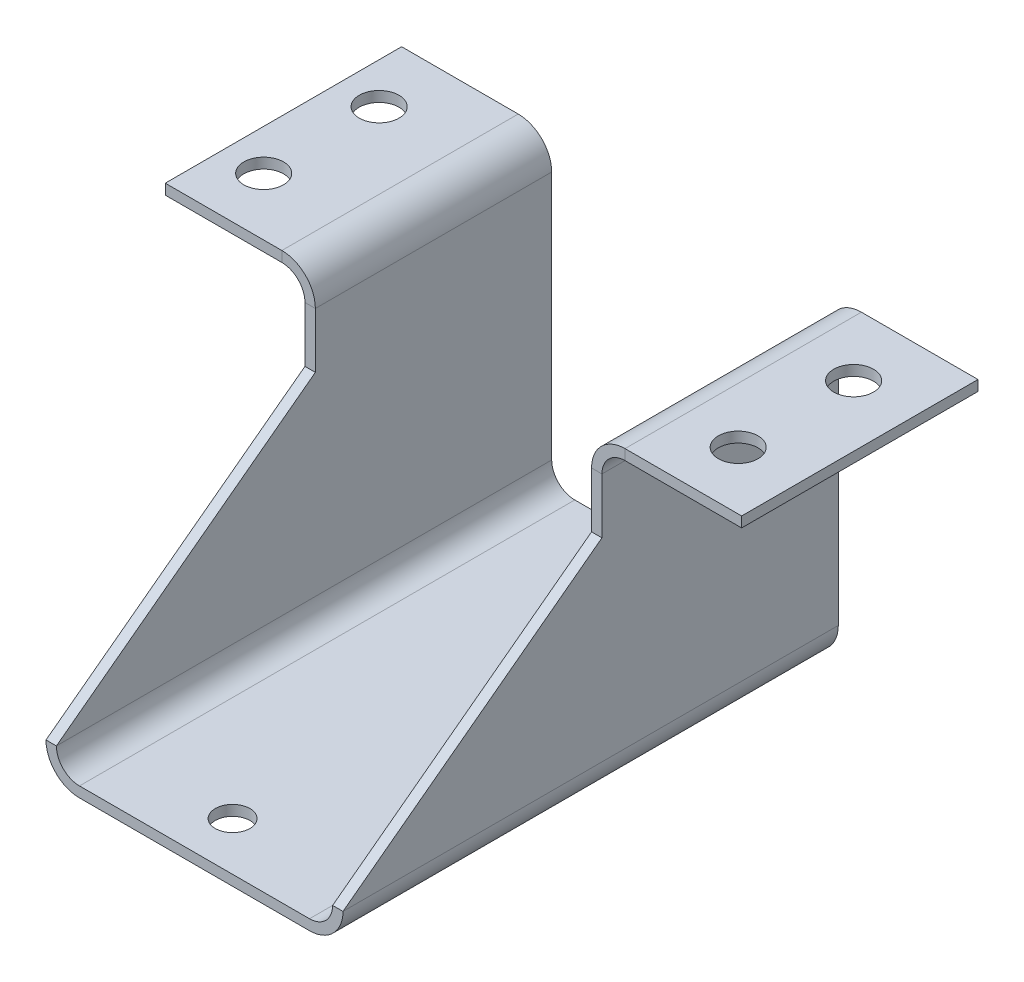
ISO-10303-21;
HEADER;
FILE_DESCRIPTION(('STEP AP214'),'2;1');
FILE_NAME('part.step','',(''),(''),'','','');
FILE_SCHEMA(('AUTOMOTIVE_DESIGN { 1 0 10303 214 1 1 1 1 }'));
ENDSEC;
DATA;
#1=APPLICATION_CONTEXT('core data for automotive mechanical design processes');
#2=APPLICATION_PROTOCOL_DEFINITION('international standard','automotive_design',2000,#1);
#3=PRODUCT_CONTEXT('',#1,'mechanical');
#4=PRODUCT('Part','Part','',(#3));
#5=PRODUCT_RELATED_PRODUCT_CATEGORY('part','',(#4));
#6=PRODUCT_DEFINITION_FORMATION('','',#4);
#7=PRODUCT_DEFINITION_CONTEXT('part definition',#1,'design');
#8=PRODUCT_DEFINITION('design','',#6,#7);
#9=PRODUCT_DEFINITION_SHAPE('','',#8);
#10=(LENGTH_UNIT() NAMED_UNIT(*) SI_UNIT(.MILLI.,.METRE.));
#11=(NAMED_UNIT(*) PLANE_ANGLE_UNIT() SI_UNIT($,.RADIAN.));
#12=(NAMED_UNIT(*) SI_UNIT($,.STERADIAN.) SOLID_ANGLE_UNIT());
#13=UNCERTAINTY_MEASURE_WITH_UNIT(LENGTH_MEASURE(1.E-05),#10,'distance_accuracy_value','');
#14=(GEOMETRIC_REPRESENTATION_CONTEXT(3) GLOBAL_UNCERTAINTY_ASSIGNED_CONTEXT((#13)) GLOBAL_UNIT_ASSIGNED_CONTEXT((#10,
#11,#12)) REPRESENTATION_CONTEXT('',''));
#15=CARTESIAN_POINT('',(0.,0.,0.));
#16=DIRECTION('',(0.,0.,1.));
#17=DIRECTION('',(1.,0.,0.));
#18=AXIS2_PLACEMENT_3D('',#15,#16,#17);
#19=CARTESIAN_POINT('',(-30.4165000000002,129.031539145061,-87.3411607187525));
#20=DIRECTION('',(0.,0.,1.));
#21=DIRECTION('',(0.,-1.,0.));
#22=AXIS2_PLACEMENT_3D('',#19,#20,#21);
#23=PLANE('',#22);
#24=DIRECTION('',(-1.,0.,0.));
#25=VECTOR('',#24,1.);
#26=CARTESIAN_POINT('',(34.9250000000002,59.944,-87.3411607187525));
#27=LINE('',#26,#25);
#28=CARTESIAN_POINT('',(34.9250000000002,59.944,-87.3411607187525));
#29=VERTEX_POINT('',#28);
#30=CARTESIAN_POINT('',(32.6390000000002,59.944,-87.3411607187525));
#31=VERTEX_POINT('',#30);
#32=EDGE_CURVE('E329',#29,#31,#27,.T.);
#33=ORIENTED_EDGE('',*,*,#32,.F.);
#34=DIRECTION('',(0.,-1.,0.));
#35=VECTOR('',#34,1.);
#36=CARTESIAN_POINT('',(34.9250000000003,129.031539145061,-87.3411607187525));
#37=LINE('',#36,#35);
#38=CARTESIAN_POINT('',(34.9250000000003,5.07999999999997,-87.3411607187525));
#39=VERTEX_POINT('',#38);
#40=EDGE_CURVE('E384',#29,#39,#37,.T.);
#41=ORIENTED_EDGE('',*,*,#40,.T.);
#42=DIRECTION('',(-1.,0.,0.));
#43=VECTOR('',#42,1.);
#44=CARTESIAN_POINT('',(34.9250000000003,5.07999999999997,-87.3411607187525));
#45=LINE('',#44,#43);
#46=CARTESIAN_POINT('',(32.639,5.07999999999998,-87.3411607187525));
#47=VERTEX_POINT('',#46);
#48=EDGE_CURVE('E13',#39,#47,#45,.T.);
#49=ORIENTED_EDGE('',*,*,#48,.T.);
#50=DIRECTION('',(0.,1.,0.));
#51=VECTOR('',#50,1.);
#52=CARTESIAN_POINT('',(32.639,-1.0916021745063E-13,-87.3411607187525));
#53=LINE('',#52,#51);
#54=EDGE_CURVE('E390',#47,#31,#53,.T.);
#55=ORIENTED_EDGE('',*,*,#54,.T.);
#56=EDGE_LOOP('',(#33,#41,#49,#55));
#57=FACE_BOUND('',#56,.T.);
#58=ADVANCED_FACE('F120',(#57),#23,.F.);
#59=CARTESIAN_POINT('',(34.925,-1.30394088607638E-13,0.));
#60=DIRECTION('',(-1.,0.,0.));
#61=DIRECTION('',(0.,-1.,0.));
#62=AXIS2_PLACEMENT_3D('',#59,#60,#61);
#63=PLANE('',#62);
#64=DIRECTION('',(0.,0.,1.));
#65=VECTOR('',#64,1.);
#66=CARTESIAN_POINT('',(34.9250000000002,59.944,-35.3411607187525));
#67=LINE('',#66,#65);
#68=CARTESIAN_POINT('',(34.9250000000002,59.944,-35.3411607187525));
#69=VERTEX_POINT('',#68);
#70=EDGE_CURVE('E324',#69,#29,#67,.F.);
#71=ORIENTED_EDGE('',*,*,#70,.F.);
#72=DIRECTION('',(0.,1.,0.));
#73=VECTOR('',#72,1.);
#74=CARTESIAN_POINT('',(34.9250000000003,149.369143464404,-35.3411607187524));
#75=LINE('',#74,#73);
#76=CARTESIAN_POINT('',(34.9250000000003,47.7691434644041,-35.3411607187525));
#77=VERTEX_POINT('',#76);
#78=EDGE_CURVE('E416',#77,#69,#75,.T.);
#79=ORIENTED_EDGE('',*,*,#78,.F.);
#80=DIRECTION('',(0.,0.599640285875703,-0.800269659274238));
#81=VECTOR('',#80,1.);
#82=CARTESIAN_POINT('',(34.9250000000003,47.7691434644041,-35.3411607187525));
#83=LINE('',#82,#81);
#84=CARTESIAN_POINT('',(34.9250000000003,5.07999999999997,21.6310392812475));
#85=VERTEX_POINT('',#84);
#86=EDGE_CURVE('E413',#85,#77,#83,.T.);
#87=ORIENTED_EDGE('',*,*,#86,.F.);
#88=DIRECTION('',(0.,0.,-1.));
#89=VECTOR('',#88,1.);
#90=CARTESIAN_POINT('',(34.925,5.07999999999998,25.4));
#91=LINE('',#90,#89);
#92=EDGE_CURVE('E452',#39,#85,#91,.F.);
#93=ORIENTED_EDGE('',*,*,#92,.F.);
#94=ORIENTED_EDGE('',*,*,#40,.F.);
#95=EDGE_LOOP('',(#71,#79,#87,#93,#94));
#96=FACE_BOUND('',#95,.T.);
#97=ADVANCED_FACE('F542',(#96),#63,.F.);
#98=CARTESIAN_POINT('',(32.639,-1.22412562267043E-13,0.));
#99=DIRECTION('',(-1.,0.,0.));
#100=DIRECTION('',(0.,-1.,0.));
#101=AXIS2_PLACEMENT_3D('',#98,#99,#100);
#102=PLANE('',#101);
#103=DIRECTION('',(0.,-1.,0.));
#104=VECTOR('',#103,1.);
#105=CARTESIAN_POINT('',(32.639,-1.15171561341796E-13,-35.3411607187525));
#106=LINE('',#105,#104);
#107=CARTESIAN_POINT('',(32.6390000000002,59.944,-35.3411607187525));
#108=VERTEX_POINT('',#107);
#109=CARTESIAN_POINT('',(32.6390000000002,47.7691434644041,-35.3411607187525));
#110=VERTEX_POINT('',#109);
#111=EDGE_CURVE('E429',#108,#110,#106,.T.);
#112=ORIENTED_EDGE('',*,*,#111,.F.);
#113=DIRECTION('',(0.,0.,1.));
#114=VECTOR('',#113,1.);
#115=CARTESIAN_POINT('',(32.6390000000002,59.944,-35.3411607187525));
#116=LINE('',#115,#114);
#117=EDGE_CURVE('E313',#108,#31,#116,.F.);
#118=ORIENTED_EDGE('',*,*,#117,.T.);
#119=ORIENTED_EDGE('',*,*,#54,.F.);
#120=DIRECTION('',(0.,0.,-1.));
#121=VECTOR('',#120,1.);
#122=CARTESIAN_POINT('',(32.639,5.07999999999998,25.4));
#123=LINE('',#122,#121);
#124=CARTESIAN_POINT('',(32.6390000000001,5.07999999999997,21.6310392812475));
#125=VERTEX_POINT('',#124);
#126=EDGE_CURVE('E451',#125,#47,#123,.T.);
#127=ORIENTED_EDGE('',*,*,#126,.F.);
#128=DIRECTION('',(0.,-0.599640285875703,0.800269659274238));
#129=VECTOR('',#128,1.);
#130=CARTESIAN_POINT('',(32.6390000000001,13.6335639306915,10.2155993022635));
#131=LINE('',#130,#129);
#132=EDGE_CURVE('E469',#110,#125,#131,.T.);
#133=ORIENTED_EDGE('',*,*,#132,.F.);
#134=EDGE_LOOP('',(#112,#118,#119,#127,#133));
#135=FACE_BOUND('',#134,.T.);
#136=ADVANCED_FACE('F550',(#135),#102,.T.);
#137=CARTESIAN_POINT('',(-30.4165000000002,149.369143464404,-35.3411607187524));
#138=DIRECTION('',(0.,0.,-1.));
#139=DIRECTION('',(0.,1.,0.));
#140=AXIS2_PLACEMENT_3D('',#137,#138,#139);
#141=PLANE('',#140);
#142=DIRECTION('',(-1.,0.,0.));
#143=VECTOR('',#142,1.);
#144=CARTESIAN_POINT('',(34.9250000000002,59.944,-35.3411607187525));
#145=LINE('',#144,#143);
#146=EDGE_CURVE('E318',#69,#108,#145,.T.);
#147=ORIENTED_EDGE('',*,*,#146,.T.);
#148=ORIENTED_EDGE('',*,*,#111,.T.);
#149=DIRECTION('',(1.,0.,0.));
#150=VECTOR('',#149,1.);
#151=CARTESIAN_POINT('',(-30.4165000000002,47.7691434644041,-35.3411607187525));
#152=LINE('',#151,#150);
#153=EDGE_CURVE('E425',#110,#77,#152,.T.);
#154=ORIENTED_EDGE('',*,*,#153,.T.);
#155=ORIENTED_EDGE('',*,*,#78,.T.);
#156=EDGE_LOOP('',(#147,#148,#154,#155));
#157=FACE_BOUND('',#156,.T.);
#158=ADVANCED_FACE('F558',(#157),#141,.F.);
#159=DIRECTION('',(1.,0.,0.));
#160=VECTOR('',#159,1.);
#161=CARTESIAN_POINT('',(-30.4165000000002,59.944,-87.3411607187524));
#162=LINE('',#161,#160);
#163=CARTESIAN_POINT('',(-30.4165000000002,59.944,-87.3411607187524));
#164=VERTEX_POINT('',#163);
#165=CARTESIAN_POINT('',(-28.1305000000002,59.944,-87.3411607187524));
#166=VERTEX_POINT('',#165);
#167=EDGE_CURVE('E371',#164,#166,#162,.T.);
#168=ORIENTED_EDGE('',*,*,#167,.T.);
#169=DIRECTION('',(0.,-1.,0.));
#170=VECTOR('',#169,1.);
#171=CARTESIAN_POINT('',(-28.1305,0.,-87.3411607187525));
#172=LINE('',#171,#170);
#173=CARTESIAN_POINT('',(-28.1305,5.07999999999999,-87.3411607187525));
#174=VERTEX_POINT('',#173);
#175=EDGE_CURVE('E402',#166,#174,#172,.T.);
#176=ORIENTED_EDGE('',*,*,#175,.T.);
#177=DIRECTION('',(-1.,0.,0.));
#178=VECTOR('',#177,1.);
#179=CARTESIAN_POINT('',(-28.1305,5.07999999999999,-87.3411607187525));
#180=LINE('',#179,#178);
#181=CARTESIAN_POINT('',(-30.4165000000002,5.07999999999997,-87.3411607187525));
#182=VERTEX_POINT('',#181);
#183=EDGE_CURVE('E478',#174,#182,#180,.T.);
#184=ORIENTED_EDGE('',*,*,#183,.T.);
#185=DIRECTION('',(0.,-1.,0.));
#186=VECTOR('',#185,1.);
#187=CARTESIAN_POINT('',(-30.4165000000002,129.031539145061,-87.3411607187525));
#188=LINE('',#187,#186);
#189=EDGE_CURVE('E388',#164,#182,#188,.T.);
#190=ORIENTED_EDGE('',*,*,#189,.F.);
#191=EDGE_LOOP('',(#168,#176,#184,#190));
#192=FACE_BOUND('',#191,.T.);
#193=ADVANCED_FACE('F545',(#192),#23,.F.);
#194=CARTESIAN_POINT('',(-30.4165,-1.14591739660438E-13,0.));
#195=DIRECTION('',(1.,0.,0.));
#196=DIRECTION('',(0.,1.,0.));
#197=AXIS2_PLACEMENT_3D('',#194,#195,#196);
#198=PLANE('',#197);
#199=DIRECTION('',(0.,0.,-1.));
#200=VECTOR('',#199,1.);
#201=CARTESIAN_POINT('',(-30.4165000000002,59.944,-87.3411607187524));
#202=LINE('',#201,#200);
#203=CARTESIAN_POINT('',(-30.4165000000002,59.944,-35.3411607187524));
#204=VERTEX_POINT('',#203);
#205=EDGE_CURVE('E377',#164,#204,#202,.F.);
#206=ORIENTED_EDGE('',*,*,#205,.F.);
#207=ORIENTED_EDGE('',*,*,#189,.T.);
#208=DIRECTION('',(0.,0.,1.));
#209=VECTOR('',#208,1.);
#210=CARTESIAN_POINT('',(-30.4165,5.07999999999997,-152.4));
#211=LINE('',#210,#209);
#212=CARTESIAN_POINT('',(-30.4165000000002,5.07999999999997,21.6310392812475));
#213=VERTEX_POINT('',#212);
#214=EDGE_CURVE('E461',#213,#182,#211,.F.);
#215=ORIENTED_EDGE('',*,*,#214,.F.);
#216=DIRECTION('',(0.,0.599640285875703,-0.800269659274238));
#217=VECTOR('',#216,1.);
#218=CARTESIAN_POINT('',(-30.4165000000002,47.7691434644041,-35.3411607187525));
#219=LINE('',#218,#217);
#220=CARTESIAN_POINT('',(-30.4165000000002,47.7691434644041,-35.3411607187525));
#221=VERTEX_POINT('',#220);
#222=EDGE_CURVE('E419',#213,#221,#219,.T.);
#223=ORIENTED_EDGE('',*,*,#222,.T.);
#224=DIRECTION('',(0.,1.,0.));
#225=VECTOR('',#224,1.);
#226=CARTESIAN_POINT('',(-30.4165000000002,149.369143464404,-35.3411607187524));
#227=LINE('',#226,#225);
#228=EDGE_CURVE('E422',#221,#204,#227,.T.);
#229=ORIENTED_EDGE('',*,*,#228,.T.);
#230=EDGE_LOOP('',(#206,#207,#215,#223,#229));
#231=FACE_BOUND('',#230,.T.);
#232=ADVANCED_FACE('F557',(#231),#198,.F.);
#233=CARTESIAN_POINT('',(-28.1305,-1.06610213319843E-13,0.));
#234=DIRECTION('',(1.,0.,0.));
#235=DIRECTION('',(0.,1.,0.));
#236=AXIS2_PLACEMENT_3D('',#233,#234,#235);
#237=PLANE('',#236);
#238=ORIENTED_EDGE('',*,*,#175,.F.);
#239=DIRECTION('',(0.,0.,-1.));
#240=VECTOR('',#239,1.);
#241=CARTESIAN_POINT('',(-28.1305000000002,59.944,-87.3411607187524));
#242=LINE('',#241,#240);
#243=CARTESIAN_POINT('',(-28.1305000000002,59.944,-35.3411607187524));
#244=VERTEX_POINT('',#243);
#245=EDGE_CURVE('E364',#166,#244,#242,.F.);
#246=ORIENTED_EDGE('',*,*,#245,.T.);
#247=DIRECTION('',(0.,1.,0.));
#248=VECTOR('',#247,1.);
#249=CARTESIAN_POINT('',(-28.1305,0.,-35.3411607187525));
#250=LINE('',#249,#248);
#251=CARTESIAN_POINT('',(-28.1305000000002,47.7691434644041,-35.3411607187525));
#252=VERTEX_POINT('',#251);
#253=EDGE_CURVE('E435',#252,#244,#250,.T.);
#254=ORIENTED_EDGE('',*,*,#253,.F.);
#255=DIRECTION('',(0.,0.599640285875703,-0.800269659274238));
#256=VECTOR('',#255,1.);
#257=CARTESIAN_POINT('',(-28.1305,13.6335639306915,10.2155993022635));
#258=LINE('',#257,#256);
#259=CARTESIAN_POINT('',(-28.1305000000001,5.07999999999997,21.6310392812475));
#260=VERTEX_POINT('',#259);
#261=EDGE_CURVE('E438',#260,#252,#258,.T.);
#262=ORIENTED_EDGE('',*,*,#261,.F.);
#263=DIRECTION('',(0.,0.,1.));
#264=VECTOR('',#263,1.);
#265=CARTESIAN_POINT('',(-28.1305,5.07999999999998,-152.4));
#266=LINE('',#265,#264);
#267=EDGE_CURVE('E459',#174,#260,#266,.T.);
#268=ORIENTED_EDGE('',*,*,#267,.F.);
#269=EDGE_LOOP('',(#238,#246,#254,#262,#268));
#270=FACE_BOUND('',#269,.T.);
#271=ADVANCED_FACE('F678',(#270),#237,.T.);
#272=DIRECTION('',(1.,0.,0.));
#273=VECTOR('',#272,1.);
#274=CARTESIAN_POINT('',(-30.4165000000002,59.944,-35.3411607187524));
#275=LINE('',#274,#273);
#276=EDGE_CURVE('E381',#204,#244,#275,.T.);
#277=ORIENTED_EDGE('',*,*,#276,.F.);
#278=ORIENTED_EDGE('',*,*,#228,.F.);
#279=EDGE_CURVE('E431',#221,#252,#152,.T.);
#280=ORIENTED_EDGE('',*,*,#279,.T.);
#281=ORIENTED_EDGE('',*,*,#253,.T.);
#282=EDGE_LOOP('',(#277,#278,#280,#281));
#283=FACE_BOUND('',#282,.T.);
#284=ADVANCED_FACE('F585',(#283),#141,.F.);
#285=DIRECTION('',(1.,0.,0.));
#286=VECTOR('',#285,1.);
#287=CARTESIAN_POINT('',(0.,0.,-87.3411607187525));
#288=LINE('',#287,#286);
#289=CARTESIAN_POINT('',(-23.0505,0.,-87.3411607187525));
#290=VERTEX_POINT('',#289);
#291=CARTESIAN_POINT('',(27.559,0.,-87.3411607187525));
#292=VERTEX_POINT('',#291);
#293=EDGE_CURVE('E396',#290,#292,#288,.T.);
#294=ORIENTED_EDGE('',*,*,#293,.T.);
#295=DIRECTION('',(0.,-1.,0.));
#296=VECTOR('',#295,1.);
#297=CARTESIAN_POINT('',(27.559,0.,-87.3411607187525));
#298=LINE('',#297,#296);
#299=CARTESIAN_POINT('',(27.559,-2.28600000000001,-87.3411607187525));
#300=VERTEX_POINT('',#299);
#301=EDGE_CURVE('E129',#292,#300,#298,.T.);
#302=ORIENTED_EDGE('',*,*,#301,.T.);
#303=DIRECTION('',(1.,0.,0.));
#304=VECTOR('',#303,1.);
#305=CARTESIAN_POINT('',(0.,-2.286,-87.3411607187525));
#306=LINE('',#305,#304);
#307=CARTESIAN_POINT('',(-23.0505,-2.286,-87.3411607187525));
#308=VERTEX_POINT('',#307);
#309=EDGE_CURVE('E407',#308,#300,#306,.T.);
#310=ORIENTED_EDGE('',*,*,#309,.F.);
#311=DIRECTION('',(0.,1.,0.));
#312=VECTOR('',#311,1.);
#313=CARTESIAN_POINT('',(-23.0505,-2.286,-87.3411607187525));
#314=LINE('',#313,#312);
#315=EDGE_CURVE('E476',#308,#290,#314,.T.);
#316=ORIENTED_EDGE('',*,*,#315,.T.);
#317=EDGE_LOOP('',(#294,#302,#310,#316));
#318=FACE_BOUND('',#317,.T.);
#319=ADVANCED_FACE('F560',(#318),#23,.F.);
#320=ORIENTED_EDGE('',*,*,#48,.F.);
#321=CARTESIAN_POINT('',(27.559,5.08,-87.3411607187525));
#322=DIRECTION('',(0.,0.,1.));
#323=DIRECTION('',(0.,-1.,0.));
#324=AXIS2_PLACEMENT_3D('',#321,#322,#323);
#325=CIRCLE('',#324,7.36600000000001);
#326=EDGE_CURVE('E404',#39,#300,#325,.F.);
#327=ORIENTED_EDGE('',*,*,#326,.T.);
#328=ORIENTED_EDGE('',*,*,#301,.F.);
#329=CARTESIAN_POINT('',(27.559,5.08,-87.3411607187525));
#330=DIRECTION('',(0.,0.,1.));
#331=DIRECTION('',(0.,-1.,0.));
#332=AXIS2_PLACEMENT_3D('',#329,#330,#331);
#333=CIRCLE('',#332,5.08000000000001);
#334=EDGE_CURVE('E393',#47,#292,#333,.F.);
#335=ORIENTED_EDGE('',*,*,#334,.F.);
#336=EDGE_LOOP('',(#320,#327,#328,#335));
#337=FACE_BOUND('',#336,.T.);
#338=ADVANCED_FACE('F565',(#337),#23,.F.);
#339=CARTESIAN_POINT('',(0.,-2.286,0.));
#340=DIRECTION('',(0.,1.,0.));
#341=DIRECTION('',(0.,0.,1.));
#342=AXIS2_PLACEMENT_3D('',#339,#340,#341);
#343=PLANE('',#342);
#344=CARTESIAN_POINT('',(0.,-2.28600000000002,10.9957926008617));
#345=DIRECTION('',(0.,1.,0.));
#346=DIRECTION('',(0.,0.,1.));
#347=AXIS2_PLACEMENT_3D('',#344,#345,#346);
#348=CIRCLE('',#347,3.81);
#349=CARTESIAN_POINT('',(0.,-2.28600000000002,14.8057926008617));
#350=VERTEX_POINT('',#349);
#351=EDGE_CURVE('E312',#350,#350,#348,.T.);
#352=ORIENTED_EDGE('',*,*,#351,.T.);
#353=EDGE_LOOP('',(#352));
#354=FACE_BOUND('',#353,.T.);
#355=CARTESIAN_POINT('',(0.,-2.28600000000002,-65.2042073991383));
#356=DIRECTION('',(0.,1.,0.));
#357=DIRECTION('',(0.,0.,1.));
#358=AXIS2_PLACEMENT_3D('',#355,#356,#357);
#359=CIRCLE('',#358,3.81);
#360=CARTESIAN_POINT('',(0.,-2.28600000000002,-61.3942073991383));
#361=VERTEX_POINT('',#360);
#362=EDGE_CURVE('E513',#361,#361,#359,.T.);
#363=ORIENTED_EDGE('',*,*,#362,.T.);
#364=EDGE_LOOP('',(#363));
#365=FACE_BOUND('',#364,.T.);
#366=DIRECTION('',(0.,0.,1.));
#367=VECTOR('',#366,1.);
#368=CARTESIAN_POINT('',(-23.0505,-2.28600000000001,25.4));
#369=LINE('',#368,#367);
#370=CARTESIAN_POINT('',(-23.0505,-2.286,21.6310392812475));
#371=VERTEX_POINT('',#370);
#372=EDGE_CURVE('E466',#371,#308,#369,.F.);
#373=ORIENTED_EDGE('',*,*,#372,.T.);
#374=ORIENTED_EDGE('',*,*,#309,.T.);
#375=DIRECTION('',(0.,0.,-1.));
#376=VECTOR('',#375,1.);
#377=CARTESIAN_POINT('',(27.559,-2.28600000000001,-152.4));
#378=LINE('',#377,#376);
#379=CARTESIAN_POINT('',(27.559,-2.28600000000001,21.6310392812475));
#380=VERTEX_POINT('',#379);
#381=EDGE_CURVE('E457',#300,#380,#378,.F.);
#382=ORIENTED_EDGE('',*,*,#381,.T.);
#383=DIRECTION('',(-1.,0.,0.));
#384=VECTOR('',#383,1.);
#385=CARTESIAN_POINT('',(0.,-2.286,21.6310392812475));
#386=LINE('',#385,#384);
#387=EDGE_CURVE('E448',#380,#371,#386,.T.);
#388=ORIENTED_EDGE('',*,*,#387,.T.);
#389=EDGE_LOOP('',(#373,#374,#382,#388));
#390=FACE_BOUND('',#389,.T.);
#391=ADVANCED_FACE('F578',(#354,#365,#390),#343,.F.);
#392=CARTESIAN_POINT('',(0.,0.,0.));
#393=DIRECTION('',(0.,1.,0.));
#394=DIRECTION('',(0.,0.,1.));
#395=AXIS2_PLACEMENT_3D('',#392,#393,#394);
#396=PLANE('',#395);
#397=CARTESIAN_POINT('',(0.,0.,10.9957926008617));
#398=DIRECTION('',(0.,1.,0.));
#399=DIRECTION('',(0.,0.,1.));
#400=AXIS2_PLACEMENT_3D('',#397,#398,#399);
#401=CIRCLE('',#400,3.81);
#402=CARTESIAN_POINT('',(0.,0.,14.8057926008617));
#403=VERTEX_POINT('',#402);
#404=EDGE_CURVE('E510',#403,#403,#401,.T.);
#405=ORIENTED_EDGE('',*,*,#404,.F.);
#406=EDGE_LOOP('',(#405));
#407=FACE_BOUND('',#406,.T.);
#408=CARTESIAN_POINT('',(0.,0.,-65.2042073991383));
#409=DIRECTION('',(0.,1.,0.));
#410=DIRECTION('',(0.,0.,1.));
#411=AXIS2_PLACEMENT_3D('',#408,#409,#410);
#412=CIRCLE('',#411,3.81);
#413=CARTESIAN_POINT('',(0.,0.,-61.3942073991383));
#414=VERTEX_POINT('',#413);
#415=EDGE_CURVE('E488',#414,#414,#412,.T.);
#416=ORIENTED_EDGE('',*,*,#415,.F.);
#417=EDGE_LOOP('',(#416));
#418=FACE_BOUND('',#417,.T.);
#419=ORIENTED_EDGE('',*,*,#293,.F.);
#420=DIRECTION('',(0.,0.,1.));
#421=VECTOR('',#420,1.);
#422=CARTESIAN_POINT('',(-23.0505,0.,25.4));
#423=LINE('',#422,#421);
#424=CARTESIAN_POINT('',(-23.0505,0.,21.6310392812475));
#425=VERTEX_POINT('',#424);
#426=EDGE_CURVE('E464',#425,#290,#423,.F.);
#427=ORIENTED_EDGE('',*,*,#426,.F.);
#428=DIRECTION('',(-1.,0.,0.));
#429=VECTOR('',#428,1.);
#430=CARTESIAN_POINT('',(0.,0.,21.6310392812475));
#431=LINE('',#430,#429);
#432=CARTESIAN_POINT('',(27.559,0.,21.6310392812475));
#433=VERTEX_POINT('',#432);
#434=EDGE_CURVE('E440',#433,#425,#431,.T.);
#435=ORIENTED_EDGE('',*,*,#434,.F.);
#436=DIRECTION('',(0.,0.,-1.));
#437=VECTOR('',#436,1.);
#438=CARTESIAN_POINT('',(27.559,0.,-152.4));
#439=LINE('',#438,#437);
#440=EDGE_CURVE('E454',#292,#433,#439,.F.);
#441=ORIENTED_EDGE('',*,*,#440,.F.);
#442=EDGE_LOOP('',(#419,#427,#435,#441));
#443=FACE_BOUND('',#442,.T.);
#444=ADVANCED_FACE('F122',(#407,#418,#443),#396,.T.);
#445=CARTESIAN_POINT('',(-23.0505,5.08000000000001,25.4));
#446=DIRECTION('',(0.,0.,1.));
#447=DIRECTION('',(-1.,0.,0.));
#448=AXIS2_PLACEMENT_3D('',#445,#446,#447);
#449=CYLINDRICAL_SURFACE('',#448,7.36600000000001);
#450=CARTESIAN_POINT('',(-23.0505,5.08,-87.3411607187525));
#451=DIRECTION('',(0.,0.,1.));
#452=DIRECTION('',(0.,-1.,0.));
#453=AXIS2_PLACEMENT_3D('',#450,#451,#452);
#454=CIRCLE('',#453,7.36600000000001);
#455=EDGE_CURVE('E410',#308,#182,#454,.F.);
#456=ORIENTED_EDGE('',*,*,#455,.F.);
#457=ORIENTED_EDGE('',*,*,#372,.F.);
#458=CARTESIAN_POINT('',(-23.0505,5.08000000000001,21.6310392812475));
#459=DIRECTION('',(0.,0.,-1.));
#460=DIRECTION('',(0.,1.,0.));
#461=AXIS2_PLACEMENT_3D('',#458,#459,#460);
#462=CIRCLE('',#461,7.36600000000001);
#463=EDGE_CURVE('E145',#213,#371,#462,.F.);
#464=ORIENTED_EDGE('',*,*,#463,.F.);
#465=ORIENTED_EDGE('',*,*,#214,.T.);
#466=EDGE_LOOP('',(#456,#457,#464,#465));
#467=FACE_BOUND('',#466,.T.);
#468=ADVANCED_FACE('F688',(#467),#449,.T.);
#469=CARTESIAN_POINT('',(-23.0505,5.08000000000001,25.4));
#470=DIRECTION('',(0.,0.,1.));
#471=DIRECTION('',(-1.,0.,0.));
#472=AXIS2_PLACEMENT_3D('',#469,#470,#471);
#473=CYLINDRICAL_SURFACE('',#472,5.08000000000002);
#474=ORIENTED_EDGE('',*,*,#426,.T.);
#475=CARTESIAN_POINT('',(-23.0505,5.08,-87.3411607187525));
#476=DIRECTION('',(0.,0.,1.));
#477=DIRECTION('',(0.,-1.,0.));
#478=AXIS2_PLACEMENT_3D('',#475,#476,#477);
#479=CIRCLE('',#478,5.08000000000002);
#480=EDGE_CURVE('E399',#290,#174,#479,.F.);
#481=ORIENTED_EDGE('',*,*,#480,.T.);
#482=ORIENTED_EDGE('',*,*,#267,.T.);
#483=CARTESIAN_POINT('',(-23.0505,5.08000000000001,21.6310392812475));
#484=DIRECTION('',(0.,0.,-1.));
#485=DIRECTION('',(0.,1.,0.));
#486=AXIS2_PLACEMENT_3D('',#483,#484,#485);
#487=CIRCLE('',#486,5.08000000000002);
#488=EDGE_CURVE('E442',#260,#425,#487,.F.);
#489=ORIENTED_EDGE('',*,*,#488,.T.);
#490=EDGE_LOOP('',(#474,#481,#482,#489));
#491=FACE_BOUND('',#490,.T.);
#492=ADVANCED_FACE('F697',(#491),#473,.F.);
#493=CARTESIAN_POINT('',(27.559,5.08,-152.4));
#494=DIRECTION('',(0.,0.,-1.));
#495=DIRECTION('',(1.,0.,0.));
#496=AXIS2_PLACEMENT_3D('',#493,#494,#495);
#497=CYLINDRICAL_SURFACE('',#496,7.36600000000001);
#498=ORIENTED_EDGE('',*,*,#326,.F.);
#499=ORIENTED_EDGE('',*,*,#92,.T.);
#500=CARTESIAN_POINT('',(27.559,5.08,21.6310392812475));
#501=DIRECTION('',(0.,0.,-1.));
#502=DIRECTION('',(0.,1.,0.));
#503=AXIS2_PLACEMENT_3D('',#500,#501,#502);
#504=CIRCLE('',#503,7.36600000000001);
#505=EDGE_CURVE('E445',#380,#85,#504,.F.);
#506=ORIENTED_EDGE('',*,*,#505,.F.);
#507=ORIENTED_EDGE('',*,*,#381,.F.);
#508=EDGE_LOOP('',(#498,#499,#506,#507));
#509=FACE_BOUND('',#508,.T.);
#510=ADVANCED_FACE('F594',(#509),#497,.T.);
#511=CARTESIAN_POINT('',(27.559,5.08,-152.4));
#512=DIRECTION('',(0.,0.,-1.));
#513=DIRECTION('',(1.,0.,0.));
#514=AXIS2_PLACEMENT_3D('',#511,#512,#513);
#515=CYLINDRICAL_SURFACE('',#514,5.08000000000001);
#516=ORIENTED_EDGE('',*,*,#126,.T.);
#517=ORIENTED_EDGE('',*,*,#334,.T.);
#518=ORIENTED_EDGE('',*,*,#440,.T.);
#519=CARTESIAN_POINT('',(27.559,5.08,21.6310392812475));
#520=DIRECTION('',(0.,0.,-1.));
#521=DIRECTION('',(0.,1.,0.));
#522=AXIS2_PLACEMENT_3D('',#519,#520,#521);
#523=CIRCLE('',#522,5.08000000000001);
#524=EDGE_CURVE('E473',#433,#125,#523,.F.);
#525=ORIENTED_EDGE('',*,*,#524,.T.);
#526=EDGE_LOOP('',(#516,#517,#518,#525));
#527=FACE_BOUND('',#526,.T.);
#528=ADVANCED_FACE('F609',(#527),#515,.F.);
#529=CARTESIAN_POINT('',(-30.4165000000002,5.07999999999997,21.6310392812475));
#530=DIRECTION('',(0.,0.,-1.));
#531=DIRECTION('',(0.,1.,0.));
#532=AXIS2_PLACEMENT_3D('',#529,#530,#531);
#533=PLANE('',#532);
#534=ORIENTED_EDGE('',*,*,#463,.T.);
#535=ORIENTED_EDGE('',*,*,#387,.F.);
#536=ORIENTED_EDGE('',*,*,#505,.T.);
#537=DIRECTION('',(1.,0.,0.));
#538=VECTOR('',#537,1.);
#539=CARTESIAN_POINT('',(-30.4165000000002,5.07999999999997,21.6310392812475));
#540=LINE('',#539,#538);
#541=EDGE_CURVE('E430',#125,#85,#540,.T.);
#542=ORIENTED_EDGE('',*,*,#541,.F.);
#543=ORIENTED_EDGE('',*,*,#524,.F.);
#544=ORIENTED_EDGE('',*,*,#434,.T.);
#545=ORIENTED_EDGE('',*,*,#488,.F.);
#546=EDGE_CURVE('E426',#213,#260,#540,.T.);
#547=ORIENTED_EDGE('',*,*,#546,.F.);
#548=EDGE_LOOP('',(#534,#535,#536,#542,#543,#544,#545,#547));
#549=FACE_BOUND('',#548,.T.);
#550=ADVANCED_FACE('F605',(#549),#533,.F.);
#551=CARTESIAN_POINT('',(-30.4165000000002,47.7691434644041,-35.3411607187525));
#552=DIRECTION('',(0.,-0.800269659274238,-0.599640285875703));
#553=DIRECTION('',(0.,0.599640285875703,-0.800269659274238));
#554=AXIS2_PLACEMENT_3D('',#551,#552,#553);
#555=PLANE('',#554);
#556=ORIENTED_EDGE('',*,*,#261,.T.);
#557=ORIENTED_EDGE('',*,*,#279,.F.);
#558=ORIENTED_EDGE('',*,*,#222,.F.);
#559=ORIENTED_EDGE('',*,*,#546,.T.);
#560=EDGE_LOOP('',(#556,#557,#558,#559));
#561=FACE_BOUND('',#560,.T.);
#562=ADVANCED_FACE('F573',(#561),#555,.F.);
#563=ORIENTED_EDGE('',*,*,#132,.T.);
#564=ORIENTED_EDGE('',*,*,#541,.T.);
#565=ORIENTED_EDGE('',*,*,#86,.T.);
#566=ORIENTED_EDGE('',*,*,#153,.F.);
#567=EDGE_LOOP('',(#563,#564,#565,#566));
#568=FACE_BOUND('',#567,.T.);
#569=ADVANCED_FACE('F563',(#568),#555,.F.);
#570=ORIENTED_EDGE('',*,*,#183,.F.);
#571=ORIENTED_EDGE('',*,*,#480,.F.);
#572=ORIENTED_EDGE('',*,*,#315,.F.);
#573=ORIENTED_EDGE('',*,*,#455,.T.);
#574=EDGE_LOOP('',(#570,#571,#572,#573));
#575=FACE_BOUND('',#574,.T.);
#576=ADVANCED_FACE('F546',(#575),#23,.F.);
#577=CARTESIAN_POINT('',(-35.4965000000002,59.944,-35.3411607187524));
#578=DIRECTION('',(0.,0.,1.));
#579=DIRECTION('',(1.,0.,0.));
#580=AXIS2_PLACEMENT_3D('',#577,#578,#579);
#581=PLANE('',#580);
#582=DIRECTION('',(0.,-1.,0.));
#583=VECTOR('',#582,1.);
#584=CARTESIAN_POINT('',(-35.4965000000002,67.31,-35.3411607187524));
#585=LINE('',#584,#583);
#586=CARTESIAN_POINT('',(-35.4965000000002,65.024,-35.3411607187524));
#587=VERTEX_POINT('',#586);
#588=CARTESIAN_POINT('',(-35.4965000000002,67.31,-35.3411607187524));
#589=VERTEX_POINT('',#588);
#590=EDGE_CURVE('E331',#587,#589,#585,.F.);
#591=ORIENTED_EDGE('',*,*,#590,.F.);
#592=CARTESIAN_POINT('',(-35.4965000000002,59.944,-35.3411607187524));
#593=DIRECTION('',(0.,0.,-1.));
#594=DIRECTION('',(-1.,0.,0.));
#595=AXIS2_PLACEMENT_3D('',#592,#593,#594);
#596=CIRCLE('',#595,5.08);
#597=EDGE_CURVE('E374',#204,#587,#596,.F.);
#598=ORIENTED_EDGE('',*,*,#597,.F.);
#599=ORIENTED_EDGE('',*,*,#276,.T.);
#600=CARTESIAN_POINT('',(-35.4965000000002,59.944,-35.3411607187524));
#601=DIRECTION('',(0.,0.,-1.));
#602=DIRECTION('',(-1.,0.,0.));
#603=AXIS2_PLACEMENT_3D('',#600,#601,#602);
#604=CIRCLE('',#603,7.366);
#605=EDGE_CURVE('E367',#244,#589,#604,.F.);
#606=ORIENTED_EDGE('',*,*,#605,.T.);
#607=EDGE_LOOP('',(#591,#598,#599,#606));
#608=FACE_BOUND('',#607,.T.);
#609=ADVANCED_FACE('F562',(#608),#581,.T.);
#610=CARTESIAN_POINT('',(-35.4965000000002,59.944,-87.3411607187524));
#611=DIRECTION('',(0.,0.,1.));
#612=DIRECTION('',(1.,0.,0.));
#613=AXIS2_PLACEMENT_3D('',#610,#611,#612);
#614=PLANE('',#613);
#615=CARTESIAN_POINT('',(-35.4965000000002,59.944,-87.3411607187524));
#616=DIRECTION('',(0.,0.,-1.));
#617=DIRECTION('',(-1.,0.,0.));
#618=AXIS2_PLACEMENT_3D('',#615,#616,#617);
#619=CIRCLE('',#618,5.08);
#620=CARTESIAN_POINT('',(-35.4965000000002,65.024,-87.3411607187524));
#621=VERTEX_POINT('',#620);
#622=EDGE_CURVE('E337',#621,#164,#619,.T.);
#623=ORIENTED_EDGE('',*,*,#622,.F.);
#624=DIRECTION('',(0.,-1.,0.));
#625=VECTOR('',#624,1.);
#626=CARTESIAN_POINT('',(-35.4965000000002,65.024,-87.3411607187524));
#627=LINE('',#626,#625);
#628=CARTESIAN_POINT('',(-35.4965000000002,67.31,-87.3411607187524));
#629=VERTEX_POINT('',#628);
#630=EDGE_CURVE('E357',#621,#629,#627,.F.);
#631=ORIENTED_EDGE('',*,*,#630,.T.);
#632=CARTESIAN_POINT('',(-35.4965000000002,59.944,-87.3411607187524));
#633=DIRECTION('',(0.,0.,-1.));
#634=DIRECTION('',(-1.,0.,0.));
#635=AXIS2_PLACEMENT_3D('',#632,#633,#634);
#636=CIRCLE('',#635,7.366);
#637=EDGE_CURVE('E368',#629,#166,#636,.T.);
#638=ORIENTED_EDGE('',*,*,#637,.T.);
#639=ORIENTED_EDGE('',*,*,#167,.F.);
#640=EDGE_LOOP('',(#623,#631,#638,#639));
#641=FACE_BOUND('',#640,.T.);
#642=ADVANCED_FACE('F570',(#641),#614,.F.);
#643=CARTESIAN_POINT('',(-35.4965000000002,59.944,-87.3411607187524));
#644=DIRECTION('',(0.,0.,-1.));
#645=DIRECTION('',(0.,1.,0.));
#646=AXIS2_PLACEMENT_3D('',#643,#644,#645);
#647=CYLINDRICAL_SURFACE('',#646,7.366);
#648=ORIENTED_EDGE('',*,*,#245,.F.);
#649=ORIENTED_EDGE('',*,*,#637,.F.);
#650=DIRECTION('',(0.,0.,-1.));
#651=VECTOR('',#650,1.);
#652=CARTESIAN_POINT('',(-35.4965000000002,67.31,-35.3411607187524));
#653=LINE('',#652,#651);
#654=EDGE_CURVE('E355',#629,#589,#653,.F.);
#655=ORIENTED_EDGE('',*,*,#654,.T.);
#656=ORIENTED_EDGE('',*,*,#605,.F.);
#657=EDGE_LOOP('',(#648,#649,#655,#656));
#658=FACE_BOUND('',#657,.T.);
#659=ADVANCED_FACE('F645',(#658),#647,.T.);
#660=CARTESIAN_POINT('',(-35.4965000000002,59.944,-87.3411607187524));
#661=DIRECTION('',(0.,0.,-1.));
#662=DIRECTION('',(0.,1.,0.));
#663=AXIS2_PLACEMENT_3D('',#660,#661,#662);
#664=CYLINDRICAL_SURFACE('',#663,5.08);
#665=ORIENTED_EDGE('',*,*,#205,.T.);
#666=ORIENTED_EDGE('',*,*,#597,.T.);
#667=DIRECTION('',(0.,0.,-1.));
#668=VECTOR('',#667,1.);
#669=CARTESIAN_POINT('',(-35.4965000000002,65.024,-35.3411607187524));
#670=LINE('',#669,#668);
#671=EDGE_CURVE('E360',#587,#621,#670,.T.);
#672=ORIENTED_EDGE('',*,*,#671,.T.);
#673=ORIENTED_EDGE('',*,*,#622,.T.);
#674=EDGE_LOOP('',(#665,#666,#672,#673));
#675=FACE_BOUND('',#674,.T.);
#676=ADVANCED_FACE('F643',(#675),#664,.F.);
#677=CARTESIAN_POINT('',(-61.1505000000003,67.31,-87.3411607187524));
#678=DIRECTION('',(0.,0.,1.));
#679=DIRECTION('',(1.,0.,0.));
#680=AXIS2_PLACEMENT_3D('',#677,#678,#679);
#681=PLANE('',#680);
#682=ORIENTED_EDGE('',*,*,#630,.F.);
#683=DIRECTION('',(1.,0.,0.));
#684=VECTOR('',#683,1.);
#685=CARTESIAN_POINT('',(-61.1505000000003,65.024,-87.3411607187524));
#686=LINE('',#685,#684);
#687=CARTESIAN_POINT('',(-61.1505000000003,65.024,-87.3411607187524));
#688=VERTEX_POINT('',#687);
#689=EDGE_CURVE('E353',#621,#688,#686,.F.);
#690=ORIENTED_EDGE('',*,*,#689,.T.);
#691=DIRECTION('',(0.,-1.,0.));
#692=VECTOR('',#691,1.);
#693=CARTESIAN_POINT('',(-61.1505000000003,67.31,-87.3411607187524));
#694=LINE('',#693,#692);
#695=CARTESIAN_POINT('',(-61.1505000000003,67.31,-87.3411607187524));
#696=VERTEX_POINT('',#695);
#697=EDGE_CURVE('E334',#696,#688,#694,.T.);
#698=ORIENTED_EDGE('',*,*,#697,.F.);
#699=DIRECTION('',(-1.,0.,0.));
#700=VECTOR('',#699,1.);
#701=CARTESIAN_POINT('',(0.,67.31,-87.3411607187524));
#702=LINE('',#701,#700);
#703=EDGE_CURVE('E346',#629,#696,#702,.T.);
#704=ORIENTED_EDGE('',*,*,#703,.F.);
#705=EDGE_LOOP('',(#682,#690,#698,#704));
#706=FACE_BOUND('',#705,.T.);
#707=ADVANCED_FACE('F638',(#706),#681,.F.);
#708=CARTESIAN_POINT('',(-30.4165000000002,67.31,-35.3411607187524));
#709=DIRECTION('',(0.,0.,-1.));
#710=DIRECTION('',(-1.,0.,0.));
#711=AXIS2_PLACEMENT_3D('',#708,#709,#710);
#712=PLANE('',#711);
#713=ORIENTED_EDGE('',*,*,#590,.T.);
#714=DIRECTION('',(1.,0.,0.));
#715=VECTOR('',#714,1.);
#716=CARTESIAN_POINT('',(0.,67.31,-35.3411607187524));
#717=LINE('',#716,#715);
#718=CARTESIAN_POINT('',(-61.1505000000003,67.31,-35.3411607187524));
#719=VERTEX_POINT('',#718);
#720=EDGE_CURVE('E341',#719,#589,#717,.T.);
#721=ORIENTED_EDGE('',*,*,#720,.F.);
#722=DIRECTION('',(0.,-1.,0.));
#723=VECTOR('',#722,1.);
#724=CARTESIAN_POINT('',(-61.1505000000003,67.31,-35.3411607187524));
#725=LINE('',#724,#723);
#726=CARTESIAN_POINT('',(-61.1505000000003,65.024,-35.3411607187524));
#727=VERTEX_POINT('',#726);
#728=EDGE_CURVE('E338',#719,#727,#725,.T.);
#729=ORIENTED_EDGE('',*,*,#728,.T.);
#730=DIRECTION('',(-1.,0.,0.));
#731=VECTOR('',#730,1.);
#732=CARTESIAN_POINT('',(-30.4165000000002,65.024,-35.3411607187524));
#733=LINE('',#732,#731);
#734=EDGE_CURVE('E348',#727,#587,#733,.F.);
#735=ORIENTED_EDGE('',*,*,#734,.T.);
#736=EDGE_LOOP('',(#713,#721,#729,#735));
#737=FACE_BOUND('',#736,.T.);
#738=ADVANCED_FACE('F633',(#737),#712,.F.);
#739=CARTESIAN_POINT('',(0.,67.31,0.));
#740=DIRECTION('',(0.,-1.,0.));
#741=DIRECTION('',(0.,0.,-1.));
#742=AXIS2_PLACEMENT_3D('',#739,#740,#741);
#743=PLANE('',#742);
#744=CARTESIAN_POINT('',(-52.1970000000003,67.31,-73.4411607187525));
#745=DIRECTION('',(0.,-1.,0.));
#746=DIRECTION('',(0.,0.,1.));
#747=AXIS2_PLACEMENT_3D('',#744,#745,#746);
#748=CIRCLE('',#747,4.3688);
#749=CARTESIAN_POINT('',(-52.1970000000003,67.31,-69.0723607187524));
#750=VERTEX_POINT('',#749);
#751=EDGE_CURVE('E491',#750,#750,#748,.T.);
#752=ORIENTED_EDGE('',*,*,#751,.T.);
#753=EDGE_LOOP('',(#752));
#754=FACE_BOUND('',#753,.T.);
#755=CARTESIAN_POINT('',(-52.1970000000003,67.31,-48.0411607187525));
#756=DIRECTION('',(0.,-1.,0.));
#757=DIRECTION('',(0.,0.,1.));
#758=AXIS2_PLACEMENT_3D('',#755,#756,#757);
#759=CIRCLE('',#758,4.3688);
#760=CARTESIAN_POINT('',(-52.1970000000003,67.31,-43.6723607187525));
#761=VERTEX_POINT('',#760);
#762=EDGE_CURVE('E497',#761,#761,#759,.T.);
#763=ORIENTED_EDGE('',*,*,#762,.T.);
#764=EDGE_LOOP('',(#763));
#765=FACE_BOUND('',#764,.T.);
#766=ORIENTED_EDGE('',*,*,#654,.F.);
#767=ORIENTED_EDGE('',*,*,#703,.T.);
#768=DIRECTION('',(0.,0.,1.));
#769=VECTOR('',#768,1.);
#770=CARTESIAN_POINT('',(-61.1505000000003,67.31,0.));
#771=LINE('',#770,#769);
#772=EDGE_CURVE('E344',#696,#719,#771,.T.);
#773=ORIENTED_EDGE('',*,*,#772,.T.);
#774=ORIENTED_EDGE('',*,*,#720,.T.);
#775=EDGE_LOOP('',(#766,#767,#773,#774));
#776=FACE_BOUND('',#775,.T.);
#777=ADVANCED_FACE('F630',(#754,#765,#776),#743,.F.);
#778=CARTESIAN_POINT('',(0.,65.024,0.));
#779=DIRECTION('',(0.,-1.,0.));
#780=DIRECTION('',(0.,0.,-1.));
#781=AXIS2_PLACEMENT_3D('',#778,#779,#780);
#782=PLANE('',#781);
#783=CARTESIAN_POINT('',(-52.1970000000003,65.024,-73.4411607187525));
#784=DIRECTION('',(0.,-1.,0.));
#785=DIRECTION('',(0.,0.,-1.));
#786=AXIS2_PLACEMENT_3D('',#783,#784,#785);
#787=CIRCLE('',#786,4.3688);
#788=CARTESIAN_POINT('',(-52.1970000000003,65.024,-77.8099607187525));
#789=VERTEX_POINT('',#788);
#790=EDGE_CURVE('E124',#789,#789,#787,.F.);
#791=ORIENTED_EDGE('',*,*,#790,.T.);
#792=EDGE_LOOP('',(#791));
#793=FACE_BOUND('',#792,.T.);
#794=CARTESIAN_POINT('',(-52.1970000000003,65.024,-48.0411607187525));
#795=DIRECTION('',(0.,-1.,0.));
#796=DIRECTION('',(0.,0.,-1.));
#797=AXIS2_PLACEMENT_3D('',#794,#795,#796);
#798=CIRCLE('',#797,4.3688);
#799=CARTESIAN_POINT('',(-52.1970000000003,65.024,-52.4099607187525));
#800=VERTEX_POINT('',#799);
#801=EDGE_CURVE('E489',#800,#800,#798,.F.);
#802=ORIENTED_EDGE('',*,*,#801,.T.);
#803=EDGE_LOOP('',(#802));
#804=FACE_BOUND('',#803,.T.);
#805=ORIENTED_EDGE('',*,*,#689,.F.);
#806=ORIENTED_EDGE('',*,*,#671,.F.);
#807=ORIENTED_EDGE('',*,*,#734,.F.);
#808=DIRECTION('',(0.,0.,-1.));
#809=VECTOR('',#808,1.);
#810=CARTESIAN_POINT('',(-61.1505000000003,65.024,-35.3411607187524));
#811=LINE('',#810,#809);
#812=EDGE_CURVE('E351',#688,#727,#811,.F.);
#813=ORIENTED_EDGE('',*,*,#812,.F.);
#814=EDGE_LOOP('',(#805,#806,#807,#813));
#815=FACE_BOUND('',#814,.T.);
#816=ADVANCED_FACE('F624',(#793,#804,#815),#782,.T.);
#817=CARTESIAN_POINT('',(-61.1505000000003,67.31,-35.3411607187524));
#818=DIRECTION('',(1.,0.,0.));
#819=DIRECTION('',(0.,1.,0.));
#820=AXIS2_PLACEMENT_3D('',#817,#818,#819);
#821=PLANE('',#820);
#822=ORIENTED_EDGE('',*,*,#812,.T.);
#823=ORIENTED_EDGE('',*,*,#728,.F.);
#824=ORIENTED_EDGE('',*,*,#772,.F.);
#825=ORIENTED_EDGE('',*,*,#697,.T.);
#826=EDGE_LOOP('',(#822,#823,#824,#825));
#827=FACE_BOUND('',#826,.T.);
#828=ADVANCED_FACE('F616',(#827),#821,.F.);
#829=CARTESIAN_POINT('',(40.0050000000002,59.944,-87.3411607187525));
#830=DIRECTION('',(0.,0.,-1.));
#831=DIRECTION('',(-1.,0.,0.));
#832=AXIS2_PLACEMENT_3D('',#829,#830,#831);
#833=PLANE('',#832);
#834=DIRECTION('',(0.,-1.,0.));
#835=VECTOR('',#834,1.);
#836=CARTESIAN_POINT('',(40.0050000000002,67.31,-87.3411607187525));
#837=LINE('',#836,#835);
#838=CARTESIAN_POINT('',(40.0050000000002,65.024,-87.3411607187525));
#839=VERTEX_POINT('',#838);
#840=CARTESIAN_POINT('',(40.0050000000002,67.31,-87.3411607187525));
#841=VERTEX_POINT('',#840);
#842=EDGE_CURVE('E295',#839,#841,#837,.F.);
#843=ORIENTED_EDGE('',*,*,#842,.F.);
#844=CARTESIAN_POINT('',(40.0050000000002,59.944,-87.3411607187525));
#845=DIRECTION('',(0.,0.,1.));
#846=DIRECTION('',(1.,0.,0.));
#847=AXIS2_PLACEMENT_3D('',#844,#845,#846);
#848=CIRCLE('',#847,5.08);
#849=EDGE_CURVE('E321',#29,#839,#848,.F.);
#850=ORIENTED_EDGE('',*,*,#849,.F.);
#851=ORIENTED_EDGE('',*,*,#32,.T.);
#852=CARTESIAN_POINT('',(40.0050000000002,59.944,-87.3411607187525));
#853=DIRECTION('',(0.,0.,1.));
#854=DIRECTION('',(1.,0.,0.));
#855=AXIS2_PLACEMENT_3D('',#852,#853,#854);
#856=CIRCLE('',#855,7.366);
#857=EDGE_CURVE('E137',#31,#841,#856,.F.);
#858=ORIENTED_EDGE('',*,*,#857,.T.);
#859=EDGE_LOOP('',(#843,#850,#851,#858));
#860=FACE_BOUND('',#859,.T.);
#861=ADVANCED_FACE('F614',(#860),#833,.T.);
#862=CARTESIAN_POINT('',(40.0050000000002,59.944,-35.3411607187525));
#863=DIRECTION('',(0.,0.,-1.));
#864=DIRECTION('',(-1.,0.,0.));
#865=AXIS2_PLACEMENT_3D('',#862,#863,#864);
#866=PLANE('',#865);
#867=CARTESIAN_POINT('',(40.0050000000002,59.944,-35.3411607187525));
#868=DIRECTION('',(0.,0.,1.));
#869=DIRECTION('',(1.,0.,0.));
#870=AXIS2_PLACEMENT_3D('',#867,#868,#869);
#871=CIRCLE('',#870,5.08);
#872=CARTESIAN_POINT('',(40.0050000000002,65.024,-35.3411607187525));
#873=VERTEX_POINT('',#872);
#874=EDGE_CURVE('E326',#873,#69,#871,.T.);
#875=ORIENTED_EDGE('',*,*,#874,.F.);
#876=DIRECTION('',(0.,-1.,0.));
#877=VECTOR('',#876,1.);
#878=CARTESIAN_POINT('',(40.0050000000002,65.024,-35.3411607187525));
#879=LINE('',#878,#877);
#880=CARTESIAN_POINT('',(40.0050000000002,67.31,-35.3411607187525));
#881=VERTEX_POINT('',#880);
#882=EDGE_CURVE('E306',#873,#881,#879,.F.);
#883=ORIENTED_EDGE('',*,*,#882,.T.);
#884=CARTESIAN_POINT('',(40.0050000000002,59.944,-35.3411607187525));
#885=DIRECTION('',(0.,0.,1.));
#886=DIRECTION('',(1.,0.,0.));
#887=AXIS2_PLACEMENT_3D('',#884,#885,#886);
#888=CIRCLE('',#887,7.366);
#889=EDGE_CURVE('E316',#881,#108,#888,.T.);
#890=ORIENTED_EDGE('',*,*,#889,.T.);
#891=ORIENTED_EDGE('',*,*,#146,.F.);
#892=EDGE_LOOP('',(#875,#883,#890,#891));
#893=FACE_BOUND('',#892,.T.);
#894=ADVANCED_FACE('F529',(#893),#866,.F.);
#895=CARTESIAN_POINT('',(40.0050000000002,59.944,-35.3411607187525));
#896=DIRECTION('',(0.,0.,1.));
#897=DIRECTION('',(0.,1.,0.));
#898=AXIS2_PLACEMENT_3D('',#895,#896,#897);
#899=CYLINDRICAL_SURFACE('',#898,7.366);
#900=ORIENTED_EDGE('',*,*,#117,.F.);
#901=ORIENTED_EDGE('',*,*,#889,.F.);
#902=DIRECTION('',(0.,0.,1.));
#903=VECTOR('',#902,1.);
#904=CARTESIAN_POINT('',(40.0050000000002,67.31,-87.3411607187525));
#905=LINE('',#904,#903);
#906=EDGE_CURVE('E304',#881,#841,#905,.F.);
#907=ORIENTED_EDGE('',*,*,#906,.T.);
#908=ORIENTED_EDGE('',*,*,#857,.F.);
#909=EDGE_LOOP('',(#900,#901,#907,#908));
#910=FACE_BOUND('',#909,.T.);
#911=ADVANCED_FACE('F622',(#910),#899,.T.);
#912=CARTESIAN_POINT('',(40.0050000000002,59.944,-35.3411607187525));
#913=DIRECTION('',(0.,0.,1.));
#914=DIRECTION('',(0.,1.,0.));
#915=AXIS2_PLACEMENT_3D('',#912,#913,#914);
#916=CYLINDRICAL_SURFACE('',#915,5.08);
#917=ORIENTED_EDGE('',*,*,#70,.T.);
#918=ORIENTED_EDGE('',*,*,#849,.T.);
#919=DIRECTION('',(0.,0.,1.));
#920=VECTOR('',#919,1.);
#921=CARTESIAN_POINT('',(40.0050000000002,65.024,-87.3411607187525));
#922=LINE('',#921,#920);
#923=EDGE_CURVE('E309',#839,#873,#922,.T.);
#924=ORIENTED_EDGE('',*,*,#923,.T.);
#925=ORIENTED_EDGE('',*,*,#874,.T.);
#926=EDGE_LOOP('',(#917,#918,#924,#925));
#927=FACE_BOUND('',#926,.T.);
#928=ADVANCED_FACE('F525',(#927),#916,.F.);
#929=CARTESIAN_POINT('',(34.9250000000003,67.31,-87.3411607187525));
#930=DIRECTION('',(0.,0.,1.));
#931=DIRECTION('',(0.,-1.,0.));
#932=AXIS2_PLACEMENT_3D('',#929,#930,#931);
#933=PLANE('',#932);
#934=ORIENTED_EDGE('',*,*,#842,.T.);
#935=DIRECTION('',(-1.,0.,0.));
#936=VECTOR('',#935,1.);
#937=CARTESIAN_POINT('',(0.,67.31,-87.3411607187525));
#938=LINE('',#937,#936);
#939=CARTESIAN_POINT('',(65.6590000000003,67.31,-87.3411607187525));
#940=VERTEX_POINT('',#939);
#941=EDGE_CURVE('E276',#940,#841,#938,.T.);
#942=ORIENTED_EDGE('',*,*,#941,.F.);
#943=DIRECTION('',(0.,-1.,0.));
#944=VECTOR('',#943,1.);
#945=CARTESIAN_POINT('',(65.6590000000003,67.31,-87.3411607187525));
#946=LINE('',#945,#944);
#947=CARTESIAN_POINT('',(65.6590000000003,65.024,-87.3411607187525));
#948=VERTEX_POINT('',#947);
#949=EDGE_CURVE('E282',#940,#948,#946,.T.);
#950=ORIENTED_EDGE('',*,*,#949,.T.);
#951=DIRECTION('',(1.,0.,0.));
#952=VECTOR('',#951,1.);
#953=CARTESIAN_POINT('',(34.9250000000003,65.024,-87.3411607187525));
#954=LINE('',#953,#952);
#955=EDGE_CURVE('E302',#948,#839,#954,.F.);
#956=ORIENTED_EDGE('',*,*,#955,.T.);
#957=EDGE_LOOP('',(#934,#942,#950,#956));
#958=FACE_BOUND('',#957,.T.);
#959=ADVANCED_FACE('F294',(#958),#933,.F.);
#960=CARTESIAN_POINT('',(65.6590000000003,67.31,-35.3411607187525));
#961=DIRECTION('',(0.,0.,-1.));
#962=DIRECTION('',(-1.,0.,0.));
#963=AXIS2_PLACEMENT_3D('',#960,#961,#962);
#964=PLANE('',#963);
#965=ORIENTED_EDGE('',*,*,#882,.F.);
#966=DIRECTION('',(-1.,0.,0.));
#967=VECTOR('',#966,1.);
#968=CARTESIAN_POINT('',(65.6590000000003,65.024,-35.3411607187525));
#969=LINE('',#968,#967);
#970=CARTESIAN_POINT('',(65.6590000000003,65.024,-35.3411607187525));
#971=VERTEX_POINT('',#970);
#972=EDGE_CURVE('E298',#873,#971,#969,.F.);
#973=ORIENTED_EDGE('',*,*,#972,.T.);
#974=DIRECTION('',(0.,-1.,0.));
#975=VECTOR('',#974,1.);
#976=CARTESIAN_POINT('',(65.6590000000003,67.31,-35.3411607187525));
#977=LINE('',#976,#975);
#978=CARTESIAN_POINT('',(65.6590000000003,67.31,-35.3411607187525));
#979=VERTEX_POINT('',#978);
#980=EDGE_CURVE('E291',#979,#971,#977,.T.);
#981=ORIENTED_EDGE('',*,*,#980,.F.);
#982=DIRECTION('',(1.,0.,0.));
#983=VECTOR('',#982,1.);
#984=CARTESIAN_POINT('',(0.,67.31,-35.3411607187525));
#985=LINE('',#984,#983);
#986=EDGE_CURVE('E278',#881,#979,#985,.T.);
#987=ORIENTED_EDGE('',*,*,#986,.F.);
#988=EDGE_LOOP('',(#965,#973,#981,#987));
#989=FACE_BOUND('',#988,.T.);
#990=ADVANCED_FACE('F530',(#989),#964,.F.);
#991=CARTESIAN_POINT('',(0.,67.31,0.));
#992=DIRECTION('',(0.,-1.,0.));
#993=DIRECTION('',(0.,0.,-1.));
#994=AXIS2_PLACEMENT_3D('',#991,#992,#993);
#995=PLANE('',#994);
#996=CARTESIAN_POINT('',(52.1970000000003,67.31,-73.4411607187525));
#997=DIRECTION('',(0.,1.,0.));
#998=DIRECTION('',(0.,0.,1.));
#999=AXIS2_PLACEMENT_3D('',#996,#997,#998);
#1000=CIRCLE('',#999,4.3688);
#1001=CARTESIAN_POINT('',(52.1970000000003,67.31,-69.0723607187524));
#1002=VERTEX_POINT('',#1001);
#1003=EDGE_CURVE('E486',#1002,#1002,#1000,.T.);
#1004=ORIENTED_EDGE('',*,*,#1003,.F.);
#1005=EDGE_LOOP('',(#1004));
#1006=FACE_BOUND('',#1005,.T.);
#1007=CARTESIAN_POINT('',(52.1970000000003,67.31,-48.0411607187525));
#1008=DIRECTION('',(0.,1.,0.));
#1009=DIRECTION('',(0.,0.,1.));
#1010=AXIS2_PLACEMENT_3D('',#1007,#1008,#1009);
#1011=CIRCLE('',#1010,4.3688);
#1012=CARTESIAN_POINT('',(52.1970000000003,67.31,-43.6723607187525));
#1013=VERTEX_POINT('',#1012);
#1014=EDGE_CURVE('E495',#1013,#1013,#1011,.T.);
#1015=ORIENTED_EDGE('',*,*,#1014,.F.);
#1016=EDGE_LOOP('',(#1015));
#1017=FACE_BOUND('',#1016,.T.);
#1018=ORIENTED_EDGE('',*,*,#906,.F.);
#1019=ORIENTED_EDGE('',*,*,#986,.T.);
#1020=DIRECTION('',(0.,0.,-1.));
#1021=VECTOR('',#1020,1.);
#1022=CARTESIAN_POINT('',(65.6590000000003,67.31,0.));
#1023=LINE('',#1022,#1021);
#1024=EDGE_CURVE('E271',#979,#940,#1023,.T.);
#1025=ORIENTED_EDGE('',*,*,#1024,.T.);
#1026=ORIENTED_EDGE('',*,*,#941,.T.);
#1027=EDGE_LOOP('',(#1018,#1019,#1025,#1026));
#1028=FACE_BOUND('',#1027,.T.);
#1029=ADVANCED_FACE('F274',(#1006,#1017,#1028),#995,.F.);
#1030=CARTESIAN_POINT('',(0.,65.024,0.));
#1031=DIRECTION('',(0.,-1.,0.));
#1032=DIRECTION('',(0.,0.,-1.));
#1033=AXIS2_PLACEMENT_3D('',#1030,#1031,#1032);
#1034=PLANE('',#1033);
#1035=CARTESIAN_POINT('',(52.1970000000003,65.024,-73.4411607187525));
#1036=DIRECTION('',(0.,-1.,0.));
#1037=DIRECTION('',(0.,0.,-1.));
#1038=AXIS2_PLACEMENT_3D('',#1035,#1036,#1037);
#1039=CIRCLE('',#1038,4.3688);
#1040=CARTESIAN_POINT('',(52.1970000000003,65.024,-77.8099607187525));
#1041=VERTEX_POINT('',#1040);
#1042=EDGE_CURVE('E485',#1041,#1041,#1039,.T.);
#1043=ORIENTED_EDGE('',*,*,#1042,.F.);
#1044=EDGE_LOOP('',(#1043));
#1045=FACE_BOUND('',#1044,.T.);
#1046=CARTESIAN_POINT('',(52.1970000000003,65.024,-48.0411607187525));
#1047=DIRECTION('',(0.,-1.,0.));
#1048=DIRECTION('',(0.,0.,-1.));
#1049=AXIS2_PLACEMENT_3D('',#1046,#1047,#1048);
#1050=CIRCLE('',#1049,4.3688);
#1051=CARTESIAN_POINT('',(52.1970000000003,65.024,-52.4099607187525));
#1052=VERTEX_POINT('',#1051);
#1053=EDGE_CURVE('E482',#1052,#1052,#1050,.T.);
#1054=ORIENTED_EDGE('',*,*,#1053,.F.);
#1055=EDGE_LOOP('',(#1054));
#1056=FACE_BOUND('',#1055,.T.);
#1057=ORIENTED_EDGE('',*,*,#972,.F.);
#1058=ORIENTED_EDGE('',*,*,#923,.F.);
#1059=ORIENTED_EDGE('',*,*,#955,.F.);
#1060=DIRECTION('',(0.,0.,1.));
#1061=VECTOR('',#1060,1.);
#1062=CARTESIAN_POINT('',(65.6590000000003,65.024,-87.3411607187525));
#1063=LINE('',#1062,#1061);
#1064=EDGE_CURVE('E287',#971,#948,#1063,.F.);
#1065=ORIENTED_EDGE('',*,*,#1064,.F.);
#1066=EDGE_LOOP('',(#1057,#1058,#1059,#1065));
#1067=FACE_BOUND('',#1066,.T.);
#1068=ADVANCED_FACE('F521',(#1045,#1056,#1067),#1034,.T.);
#1069=CARTESIAN_POINT('',(65.6590000000003,67.31,-87.3411607187525));
#1070=DIRECTION('',(-1.,0.,0.));
#1071=DIRECTION('',(0.,-1.,0.));
#1072=AXIS2_PLACEMENT_3D('',#1069,#1070,#1071);
#1073=PLANE('',#1072);
#1074=ORIENTED_EDGE('',*,*,#1064,.T.);
#1075=ORIENTED_EDGE('',*,*,#949,.F.);
#1076=ORIENTED_EDGE('',*,*,#1024,.F.);
#1077=ORIENTED_EDGE('',*,*,#980,.T.);
#1078=EDGE_LOOP('',(#1074,#1075,#1076,#1077));
#1079=FACE_BOUND('',#1078,.T.);
#1080=ADVANCED_FACE('F285',(#1079),#1073,.F.);
#1081=CARTESIAN_POINT('',(0.,-2.28600000000002,-65.2042073991383));
#1082=DIRECTION('',(0.,1.,0.));
#1083=DIRECTION('',(0.,0.,1.));
#1084=AXIS2_PLACEMENT_3D('',#1081,#1082,#1083);
#1085=CYLINDRICAL_SURFACE('',#1084,3.81);
#1086=ORIENTED_EDGE('',*,*,#362,.F.);
#1087=EDGE_LOOP('',(#1086));
#1088=FACE_BOUND('',#1087,.T.);
#1089=ORIENTED_EDGE('',*,*,#415,.T.);
#1090=EDGE_LOOP('',(#1089));
#1091=FACE_BOUND('',#1090,.T.);
#1092=ADVANCED_FACE('F920',(#1088,#1091),#1085,.F.);
#1093=CARTESIAN_POINT('',(0.,-2.28600000000002,10.9957926008617));
#1094=DIRECTION('',(0.,1.,0.));
#1095=DIRECTION('',(0.,0.,1.));
#1096=AXIS2_PLACEMENT_3D('',#1093,#1094,#1095);
#1097=CYLINDRICAL_SURFACE('',#1096,3.81);
#1098=ORIENTED_EDGE('',*,*,#351,.F.);
#1099=EDGE_LOOP('',(#1098));
#1100=FACE_BOUND('',#1099,.T.);
#1101=ORIENTED_EDGE('',*,*,#404,.T.);
#1102=EDGE_LOOP('',(#1101));
#1103=FACE_BOUND('',#1102,.T.);
#1104=ADVANCED_FACE('F945',(#1100,#1103),#1097,.F.);
#1105=CARTESIAN_POINT('',(52.1970000000003,-2.28600000000002,-48.0411607187525));
#1106=DIRECTION('',(0.,1.,0.));
#1107=DIRECTION('',(0.,0.,1.));
#1108=AXIS2_PLACEMENT_3D('',#1105,#1106,#1107);
#1109=CYLINDRICAL_SURFACE('',#1108,4.3688);
#1110=ORIENTED_EDGE('',*,*,#1053,.T.);
#1111=EDGE_LOOP('',(#1110));
#1112=FACE_BOUND('',#1111,.T.);
#1113=ORIENTED_EDGE('',*,*,#1014,.T.);
#1114=EDGE_LOOP('',(#1113));
#1115=FACE_BOUND('',#1114,.T.);
#1116=ADVANCED_FACE('F956',(#1112,#1115),#1109,.F.);
#1117=CARTESIAN_POINT('',(52.1970000000003,-2.28600000000002,-73.4411607187525));
#1118=DIRECTION('',(0.,1.,0.));
#1119=DIRECTION('',(0.,0.,1.));
#1120=AXIS2_PLACEMENT_3D('',#1117,#1118,#1119);
#1121=CYLINDRICAL_SURFACE('',#1120,4.3688);
#1122=ORIENTED_EDGE('',*,*,#1042,.T.);
#1123=EDGE_LOOP('',(#1122));
#1124=FACE_BOUND('',#1123,.T.);
#1125=ORIENTED_EDGE('',*,*,#1003,.T.);
#1126=EDGE_LOOP('',(#1125));
#1127=FACE_BOUND('',#1126,.T.);
#1128=ADVANCED_FACE('F981',(#1124,#1127),#1121,.F.);
#1129=CARTESIAN_POINT('',(-52.1970000000003,-2.28600000000002,-48.0411607187525));
#1130=DIRECTION('',(0.,1.,0.));
#1131=DIRECTION('',(0.,0.,1.));
#1132=AXIS2_PLACEMENT_3D('',#1129,#1130,#1131);
#1133=CYLINDRICAL_SURFACE('',#1132,4.3688);
#1134=ORIENTED_EDGE('',*,*,#801,.F.);
#1135=EDGE_LOOP('',(#1134));
#1136=FACE_BOUND('',#1135,.T.);
#1137=ORIENTED_EDGE('',*,*,#762,.F.);
#1138=EDGE_LOOP('',(#1137));
#1139=FACE_BOUND('',#1138,.T.);
#1140=ADVANCED_FACE('F992',(#1136,#1139),#1133,.F.);
#1141=CARTESIAN_POINT('',(-52.1970000000003,-2.28600000000002,-73.4411607187525));
#1142=DIRECTION('',(0.,1.,0.));
#1143=DIRECTION('',(0.,0.,1.));
#1144=AXIS2_PLACEMENT_3D('',#1141,#1142,#1143);
#1145=CYLINDRICAL_SURFACE('',#1144,4.3688);
#1146=ORIENTED_EDGE('',*,*,#790,.F.);
#1147=EDGE_LOOP('',(#1146));
#1148=FACE_BOUND('',#1147,.T.);
#1149=ORIENTED_EDGE('',*,*,#751,.F.);
#1150=EDGE_LOOP('',(#1149));
#1151=FACE_BOUND('',#1150,.T.);
#1152=ADVANCED_FACE('F1015',(#1148,#1151),#1145,.F.);
#1153=CLOSED_SHELL('',(#58,#97,#136,#158,#193,#232,#271,#284,#319,#338,#391,#444,#468,#492,#510,
#528,#550,#562,#569,#576,#609,#642,#659,#676,#707,#738,#777,#816,#828,#861,#894,#911,#928,#959,
#990,#1029,#1068,#1080,#1092,#1104,#1116,#1128,#1140,#1152));
#1154=MANIFOLD_SOLID_BREP('B2',#1153);
#1155=ADVANCED_BREP_SHAPE_REPRESENTATION('',(#18,#1154),#14);
#1156=SHAPE_DEFINITION_REPRESENTATION(#9,#1155);
ENDSEC;
END-ISO-10303-21;
